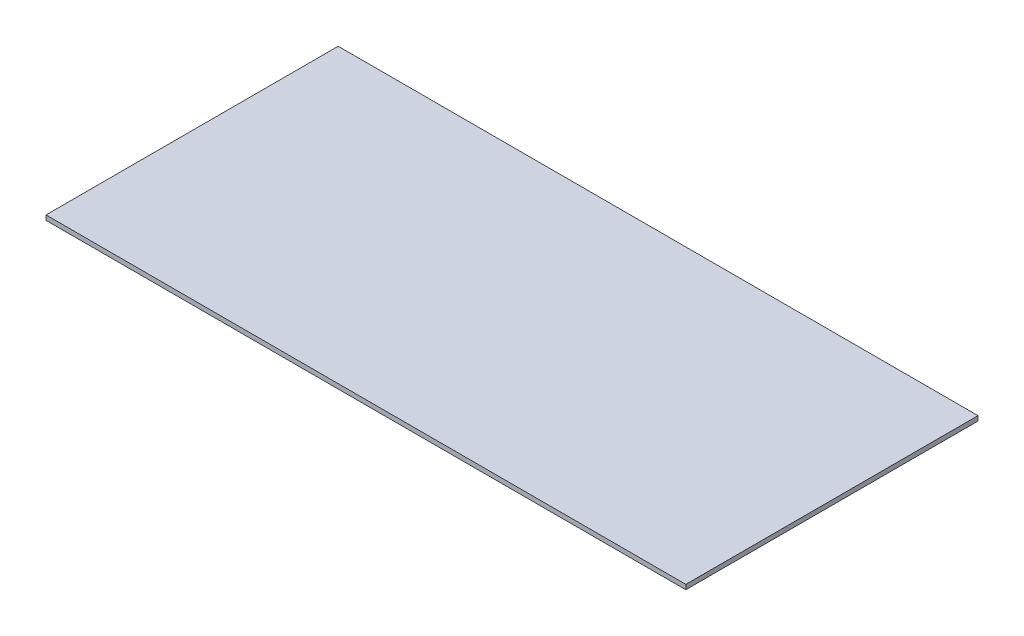
ISO-10303-21;
HEADER;
FILE_DESCRIPTION(('STEP AP214'),'2;1');
FILE_NAME('part.step','',(''),(''),'','','');
FILE_SCHEMA(('AUTOMOTIVE_DESIGN { 1 0 10303 214 1 1 1 1 }'));
ENDSEC;
DATA;
#1=APPLICATION_CONTEXT('core data for automotive mechanical design processes');
#2=APPLICATION_PROTOCOL_DEFINITION('international standard','automotive_design',2000,#1);
#3=PRODUCT_CONTEXT('',#1,'mechanical');
#4=PRODUCT('Part','Part','',(#3));
#5=PRODUCT_RELATED_PRODUCT_CATEGORY('part','',(#4));
#6=PRODUCT_DEFINITION_FORMATION('','',#4);
#7=PRODUCT_DEFINITION_CONTEXT('part definition',#1,'design');
#8=PRODUCT_DEFINITION('design','',#6,#7);
#9=PRODUCT_DEFINITION_SHAPE('','',#8);
#10=(LENGTH_UNIT() NAMED_UNIT(*) SI_UNIT(.MILLI.,.METRE.));
#11=(NAMED_UNIT(*) PLANE_ANGLE_UNIT() SI_UNIT($,.RADIAN.));
#12=(NAMED_UNIT(*) SI_UNIT($,.STERADIAN.) SOLID_ANGLE_UNIT());
#13=UNCERTAINTY_MEASURE_WITH_UNIT(LENGTH_MEASURE(1.E-05),#10,'distance_accuracy_value','');
#14=(GEOMETRIC_REPRESENTATION_CONTEXT(3) GLOBAL_UNCERTAINTY_ASSIGNED_CONTEXT((#13)) GLOBAL_UNIT_ASSIGNED_CONTEXT((#10,
#11,#12)) REPRESENTATION_CONTEXT('',''));
#15=CARTESIAN_POINT('',(0.,0.,0.));
#16=DIRECTION('',(0.,0.,1.));
#17=DIRECTION('',(1.,0.,0.));
#18=AXIS2_PLACEMENT_3D('',#15,#16,#17);
#19=CARTESIAN_POINT('',(-865.,12.7,395.));
#20=DIRECTION('',(1.,0.,0.));
#21=DIRECTION('',(0.,0.,-1.));
#22=AXIS2_PLACEMENT_3D('',#19,#20,#21);
#23=PLANE('',#22);
#24=DIRECTION('',(0.,0.,1.));
#25=VECTOR('',#24,1.);
#26=CARTESIAN_POINT('',(-865.,0.,395.));
#27=LINE('',#26,#25);
#28=CARTESIAN_POINT('',(-865.,0.,-395.));
#29=VERTEX_POINT('',#28);
#30=CARTESIAN_POINT('',(-865.,0.,395.));
#31=VERTEX_POINT('',#30);
#32=EDGE_CURVE('E102',#29,#31,#27,.T.);
#33=ORIENTED_EDGE('',*,*,#32,.T.);
#34=DIRECTION('',(0.,-1.,0.));
#35=VECTOR('',#34,1.);
#36=CARTESIAN_POINT('',(-865.,12.7,395.));
#37=LINE('',#36,#35);
#38=CARTESIAN_POINT('',(-865.,12.7,395.));
#39=VERTEX_POINT('',#38);
#40=EDGE_CURVE('E11',#39,#31,#37,.T.);
#41=ORIENTED_EDGE('',*,*,#40,.F.);
#42=DIRECTION('',(0.,0.,1.));
#43=VECTOR('',#42,1.);
#44=CARTESIAN_POINT('',(-865.,12.7,395.));
#45=LINE('',#44,#43);
#46=CARTESIAN_POINT('',(-865.,12.7,-395.));
#47=VERTEX_POINT('',#46);
#48=EDGE_CURVE('E90',#47,#39,#45,.T.);
#49=ORIENTED_EDGE('',*,*,#48,.F.);
#50=DIRECTION('',(0.,-1.,0.));
#51=VECTOR('',#50,1.);
#52=CARTESIAN_POINT('',(-865.,12.7,-395.));
#53=LINE('',#52,#51);
#54=EDGE_CURVE('E98',#47,#29,#53,.T.);
#55=ORIENTED_EDGE('',*,*,#54,.T.);
#56=EDGE_LOOP('',(#33,#41,#49,#55));
#57=FACE_BOUND('',#56,.T.);
#58=ADVANCED_FACE('F39',(#57),#23,.F.);
#59=CARTESIAN_POINT('',(865.,12.7,395.));
#60=DIRECTION('',(0.,0.,-1.));
#61=DIRECTION('',(-1.,0.,0.));
#62=AXIS2_PLACEMENT_3D('',#59,#60,#61);
#63=PLANE('',#62);
#64=DIRECTION('',(1.,0.,0.));
#65=VECTOR('',#64,1.);
#66=CARTESIAN_POINT('',(865.,0.,395.));
#67=LINE('',#66,#65);
#68=CARTESIAN_POINT('',(865.,0.,395.));
#69=VERTEX_POINT('',#68);
#70=EDGE_CURVE('E94',#31,#69,#67,.T.);
#71=ORIENTED_EDGE('',*,*,#70,.T.);
#72=DIRECTION('',(0.,-1.,0.));
#73=VECTOR('',#72,1.);
#74=CARTESIAN_POINT('',(865.,12.7,395.));
#75=LINE('',#74,#73);
#76=CARTESIAN_POINT('',(865.,12.7,395.));
#77=VERTEX_POINT('',#76);
#78=EDGE_CURVE('E47',#77,#69,#75,.T.);
#79=ORIENTED_EDGE('',*,*,#78,.F.);
#80=DIRECTION('',(1.,0.,0.));
#81=VECTOR('',#80,1.);
#82=CARTESIAN_POINT('',(865.,12.7,395.));
#83=LINE('',#82,#81);
#84=EDGE_CURVE('E85',#39,#77,#83,.T.);
#85=ORIENTED_EDGE('',*,*,#84,.F.);
#86=ORIENTED_EDGE('',*,*,#40,.T.);
#87=EDGE_LOOP('',(#71,#79,#85,#86));
#88=FACE_BOUND('',#87,.T.);
#89=ADVANCED_FACE('F93',(#88),#63,.F.);
#90=CARTESIAN_POINT('',(865.,12.7,395.));
#91=DIRECTION('',(-1.,0.,0.));
#92=DIRECTION('',(0.,0.,1.));
#93=AXIS2_PLACEMENT_3D('',#90,#91,#92);
#94=PLANE('',#93);
#95=DIRECTION('',(0.,0.,-1.));
#96=VECTOR('',#95,1.);
#97=CARTESIAN_POINT('',(865.,0.,395.));
#98=LINE('',#97,#96);
#99=CARTESIAN_POINT('',(865.,0.,-395.));
#100=VERTEX_POINT('',#99);
#101=EDGE_CURVE('E72',#69,#100,#98,.T.);
#102=ORIENTED_EDGE('',*,*,#101,.T.);
#103=DIRECTION('',(0.,-1.,0.));
#104=VECTOR('',#103,1.);
#105=CARTESIAN_POINT('',(865.,12.7,-395.));
#106=LINE('',#105,#104);
#107=CARTESIAN_POINT('',(865.,12.7,-395.));
#108=VERTEX_POINT('',#107);
#109=EDGE_CURVE('E95',#108,#100,#106,.T.);
#110=ORIENTED_EDGE('',*,*,#109,.F.);
#111=DIRECTION('',(0.,0.,-1.));
#112=VECTOR('',#111,1.);
#113=CARTESIAN_POINT('',(865.,12.7,395.));
#114=LINE('',#113,#112);
#115=EDGE_CURVE('E88',#77,#108,#114,.T.);
#116=ORIENTED_EDGE('',*,*,#115,.F.);
#117=ORIENTED_EDGE('',*,*,#78,.T.);
#118=EDGE_LOOP('',(#102,#110,#116,#117));
#119=FACE_BOUND('',#118,.T.);
#120=ADVANCED_FACE('F96',(#119),#94,.F.);
#121=CARTESIAN_POINT('',(865.,12.7,-395.));
#122=DIRECTION('',(0.,0.,1.));
#123=DIRECTION('',(1.,0.,0.));
#124=AXIS2_PLACEMENT_3D('',#121,#122,#123);
#125=PLANE('',#124);
#126=DIRECTION('',(-1.,0.,0.));
#127=VECTOR('',#126,1.);
#128=CARTESIAN_POINT('',(865.,0.,-395.));
#129=LINE('',#128,#127);
#130=EDGE_CURVE('E78',#100,#29,#129,.T.);
#131=ORIENTED_EDGE('',*,*,#130,.T.);
#132=ORIENTED_EDGE('',*,*,#54,.F.);
#133=DIRECTION('',(-1.,0.,0.));
#134=VECTOR('',#133,1.);
#135=CARTESIAN_POINT('',(865.,12.7,-395.));
#136=LINE('',#135,#134);
#137=EDGE_CURVE('E55',#108,#47,#136,.T.);
#138=ORIENTED_EDGE('',*,*,#137,.F.);
#139=ORIENTED_EDGE('',*,*,#109,.T.);
#140=EDGE_LOOP('',(#131,#132,#138,#139));
#141=FACE_BOUND('',#140,.T.);
#142=ADVANCED_FACE('F109',(#141),#125,.F.);
#143=CARTESIAN_POINT('',(0.,12.7,0.));
#144=DIRECTION('',(0.,1.,0.));
#145=DIRECTION('',(0.,0.,1.));
#146=AXIS2_PLACEMENT_3D('',#143,#144,#145);
#147=PLANE('',#146);
#148=ORIENTED_EDGE('',*,*,#48,.T.);
#149=ORIENTED_EDGE('',*,*,#84,.T.);
#150=ORIENTED_EDGE('',*,*,#115,.T.);
#151=ORIENTED_EDGE('',*,*,#137,.T.);
#152=EDGE_LOOP('',(#148,#149,#150,#151));
#153=FACE_BOUND('',#152,.T.);
#154=ADVANCED_FACE('F86',(#153),#147,.T.);
#155=CARTESIAN_POINT('',(0.,0.,0.));
#156=DIRECTION('',(0.,1.,0.));
#157=DIRECTION('',(0.,0.,1.));
#158=AXIS2_PLACEMENT_3D('',#155,#156,#157);
#159=PLANE('',#158);
#160=ORIENTED_EDGE('',*,*,#32,.F.);
#161=ORIENTED_EDGE('',*,*,#130,.F.);
#162=ORIENTED_EDGE('',*,*,#101,.F.);
#163=ORIENTED_EDGE('',*,*,#70,.F.);
#164=EDGE_LOOP('',(#160,#161,#162,#163));
#165=FACE_BOUND('',#164,.T.);
#166=ADVANCED_FACE('F112',(#165),#159,.F.);
#167=CLOSED_SHELL('',(#58,#89,#120,#142,#154,#166));
#168=MANIFOLD_SOLID_BREP('B2',#167);
#169=ADVANCED_BREP_SHAPE_REPRESENTATION('',(#18,#168),#14);
#170=SHAPE_DEFINITION_REPRESENTATION(#9,#169);
ENDSEC;
END-ISO-10303-21;
